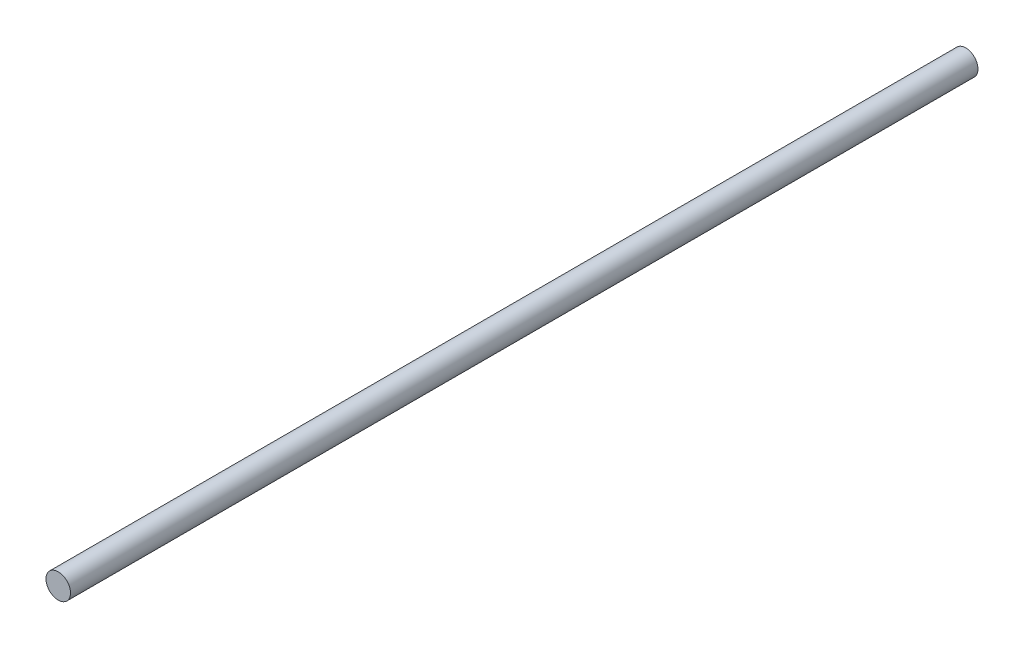
ISO-10303-21;
HEADER;
FILE_DESCRIPTION(('STEP AP214'),'2;1');
FILE_NAME('part.step','',(''),(''),'','','');
FILE_SCHEMA(('AUTOMOTIVE_DESIGN { 1 0 10303 214 1 1 1 1 }'));
ENDSEC;
DATA;
#1=APPLICATION_CONTEXT('core data for automotive mechanical design processes');
#2=APPLICATION_PROTOCOL_DEFINITION('international standard','automotive_design',2000,#1);
#3=PRODUCT_CONTEXT('',#1,'mechanical');
#4=PRODUCT('Part','Part','',(#3));
#5=PRODUCT_RELATED_PRODUCT_CATEGORY('part','',(#4));
#6=PRODUCT_DEFINITION_FORMATION('','',#4);
#7=PRODUCT_DEFINITION_CONTEXT('part definition',#1,'design');
#8=PRODUCT_DEFINITION('design','',#6,#7);
#9=PRODUCT_DEFINITION_SHAPE('','',#8);
#10=(LENGTH_UNIT() NAMED_UNIT(*) SI_UNIT(.MILLI.,.METRE.));
#11=(NAMED_UNIT(*) PLANE_ANGLE_UNIT() SI_UNIT($,.RADIAN.));
#12=(NAMED_UNIT(*) SI_UNIT($,.STERADIAN.) SOLID_ANGLE_UNIT());
#13=UNCERTAINTY_MEASURE_WITH_UNIT(LENGTH_MEASURE(1.E-05),#10,'distance_accuracy_value','');
#14=(GEOMETRIC_REPRESENTATION_CONTEXT(3) GLOBAL_UNCERTAINTY_ASSIGNED_CONTEXT((#13)) GLOBAL_UNIT_ASSIGNED_CONTEXT((#10,
#11,#12)) REPRESENTATION_CONTEXT('',''));
#15=CARTESIAN_POINT('',(0.,0.,0.));
#16=DIRECTION('',(0.,0.,1.));
#17=DIRECTION('',(1.,0.,0.));
#18=AXIS2_PLACEMENT_3D('',#15,#16,#17);
#19=CARTESIAN_POINT('',(0.,0.,152.4));
#20=DIRECTION('',(0.,0.,-1.));
#21=DIRECTION('',(-1.,0.,0.));
#22=AXIS2_PLACEMENT_3D('',#19,#20,#21);
#23=CYLINDRICAL_SURFACE('',#22,2.06121);
#24=CARTESIAN_POINT('',(0.,0.,152.4));
#25=DIRECTION('',(0.,0.,1.));
#26=DIRECTION('',(1.,0.,0.));
#27=AXIS2_PLACEMENT_3D('',#24,#25,#26);
#28=CIRCLE('',#27,2.06121);
#29=CARTESIAN_POINT('',(2.06121,0.,152.4));
#30=VERTEX_POINT('',#29);
#31=EDGE_CURVE('E12',#30,#30,#28,.T.);
#32=ORIENTED_EDGE('',*,*,#31,.F.);
#33=EDGE_LOOP('',(#32));
#34=FACE_BOUND('',#33,.T.);
#35=CARTESIAN_POINT('',(0.,0.,0.));
#36=DIRECTION('',(0.,0.,1.));
#37=DIRECTION('',(1.,0.,0.));
#38=AXIS2_PLACEMENT_3D('',#35,#36,#37);
#39=CIRCLE('',#38,2.06121);
#40=CARTESIAN_POINT('',(2.06121,0.,0.));
#41=VERTEX_POINT('',#40);
#42=EDGE_CURVE('E43',#41,#41,#39,.T.);
#43=ORIENTED_EDGE('',*,*,#42,.T.);
#44=EDGE_LOOP('',(#43));
#45=FACE_BOUND('',#44,.T.);
#46=ADVANCED_FACE('F40',(#34,#45),#23,.T.);
#47=CARTESIAN_POINT('',(0.,0.,152.4));
#48=DIRECTION('',(0.,0.,1.));
#49=DIRECTION('',(1.,0.,0.));
#50=AXIS2_PLACEMENT_3D('',#47,#48,#49);
#51=PLANE('',#50);
#52=ORIENTED_EDGE('',*,*,#31,.T.);
#53=EDGE_LOOP('',(#52));
#54=FACE_BOUND('',#53,.T.);
#55=ADVANCED_FACE('F55',(#54),#51,.T.);
#56=CARTESIAN_POINT('',(0.,0.,0.));
#57=DIRECTION('',(0.,0.,1.));
#58=DIRECTION('',(1.,0.,0.));
#59=AXIS2_PLACEMENT_3D('',#56,#57,#58);
#60=PLANE('',#59);
#61=ORIENTED_EDGE('',*,*,#42,.F.);
#62=EDGE_LOOP('',(#61));
#63=FACE_BOUND('',#62,.T.);
#64=ADVANCED_FACE('F53',(#63),#60,.F.);
#65=CLOSED_SHELL('',(#46,#55,#64));
#66=MANIFOLD_SOLID_BREP('B2',#65);
#67=ADVANCED_BREP_SHAPE_REPRESENTATION('',(#18,#66),#14);
#68=SHAPE_DEFINITION_REPRESENTATION(#9,#67);
ENDSEC;
END-ISO-10303-21;
